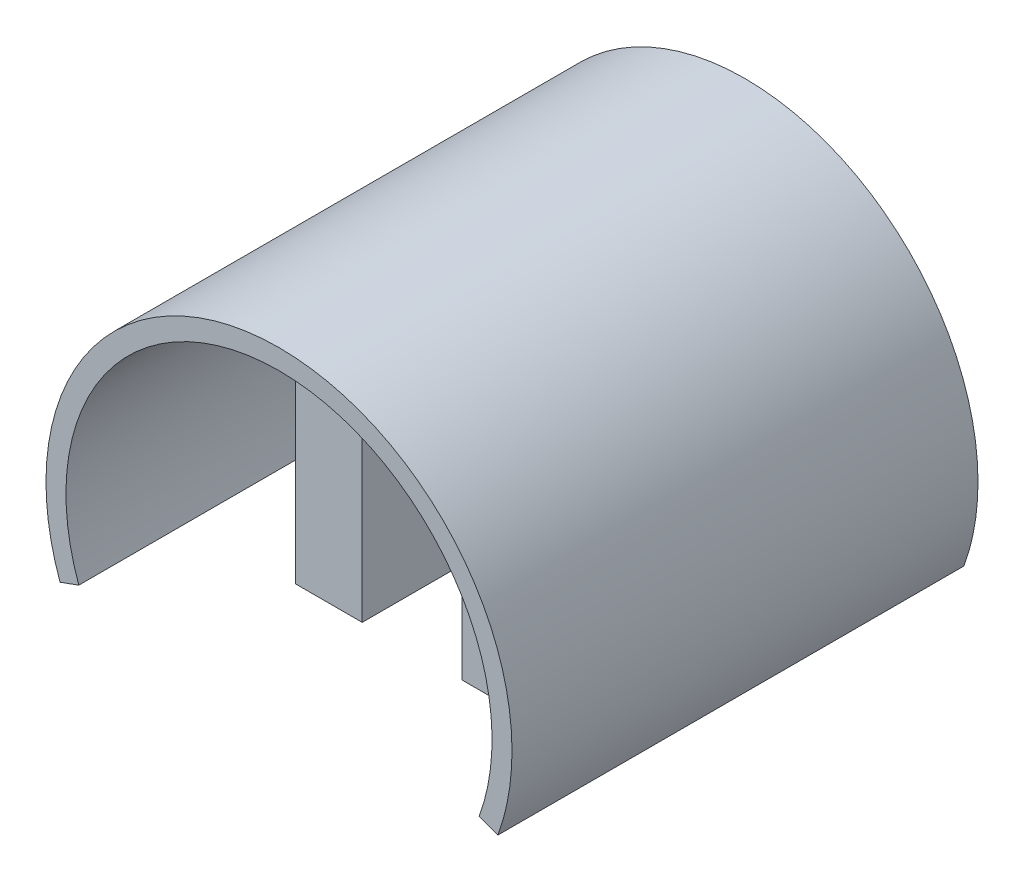
ISO-10303-21;
HEADER;
FILE_DESCRIPTION(('STEP AP214'),'2;1');
FILE_NAME('part.step','',(''),(''),'','','');
FILE_SCHEMA(('AUTOMOTIVE_DESIGN { 1 0 10303 214 1 1 1 1 }'));
ENDSEC;
DATA;
#1=APPLICATION_CONTEXT('core data for automotive mechanical design processes');
#2=APPLICATION_PROTOCOL_DEFINITION('international standard','automotive_design',2000,#1);
#3=PRODUCT_CONTEXT('',#1,'mechanical');
#4=PRODUCT('Part','Part','',(#3));
#5=PRODUCT_RELATED_PRODUCT_CATEGORY('part','',(#4));
#6=PRODUCT_DEFINITION_FORMATION('','',#4);
#7=PRODUCT_DEFINITION_CONTEXT('part definition',#1,'design');
#8=PRODUCT_DEFINITION('design','',#6,#7);
#9=PRODUCT_DEFINITION_SHAPE('','',#8);
#10=(LENGTH_UNIT() NAMED_UNIT(*) SI_UNIT(.MILLI.,.METRE.));
#11=(NAMED_UNIT(*) PLANE_ANGLE_UNIT() SI_UNIT($,.RADIAN.));
#12=(NAMED_UNIT(*) SI_UNIT($,.STERADIAN.) SOLID_ANGLE_UNIT());
#13=UNCERTAINTY_MEASURE_WITH_UNIT(LENGTH_MEASURE(1.E-05),#10,'distance_accuracy_value','');
#14=(GEOMETRIC_REPRESENTATION_CONTEXT(3) GLOBAL_UNCERTAINTY_ASSIGNED_CONTEXT((#13)) GLOBAL_UNIT_ASSIGNED_CONTEXT((#10,
#11,#12)) REPRESENTATION_CONTEXT('',''));
#15=CARTESIAN_POINT('',(0.,0.,0.));
#16=DIRECTION('',(0.,0.,1.));
#17=DIRECTION('',(1.,0.,0.));
#18=AXIS2_PLACEMENT_3D('',#15,#16,#17);
#19=CARTESIAN_POINT('',(-7.49999999999999,31.1086804606046,0.));
#20=DIRECTION('',(1.,0.,0.));
#21=DIRECTION('',(0.,1.,0.));
#22=AXIS2_PLACEMENT_3D('',#19,#20,#21);
#23=PLANE('',#22);
#24=DIRECTION('',(0.,1.,0.));
#25=VECTOR('',#24,1.);
#26=CARTESIAN_POINT('',(-7.49999999999999,31.1086804606046,0.));
#27=LINE('',#26,#25);
#28=CARTESIAN_POINT('',(-7.5,-14.5,0.));
#29=VERTEX_POINT('',#28);
#30=CARTESIAN_POINT('',(-7.49999999999999,29.4915242061173,0.));
#31=VERTEX_POINT('',#30);
#32=EDGE_CURVE('E199',#29,#31,#27,.T.);
#33=ORIENTED_EDGE('',*,*,#32,.T.);
#34=DIRECTION('',(0.,0.,1.));
#35=VECTOR('',#34,1.);
#36=CARTESIAN_POINT('',(-7.49999999999999,29.4915242061173,50.));
#37=LINE('',#36,#35);
#38=CARTESIAN_POINT('',(-7.49999999999999,29.4915242061173,50.));
#39=VERTEX_POINT('',#38);
#40=EDGE_CURVE('E226',#31,#39,#37,.T.);
#41=ORIENTED_EDGE('',*,*,#40,.T.);
#42=DIRECTION('',(0.,-1.,0.));
#43=VECTOR('',#42,1.);
#44=CARTESIAN_POINT('',(-7.49999999999999,31.1086804606046,50.));
#45=LINE('',#44,#43);
#46=CARTESIAN_POINT('',(-7.5,-14.5,50.));
#47=VERTEX_POINT('',#46);
#48=EDGE_CURVE('E280',#39,#47,#45,.T.);
#49=ORIENTED_EDGE('',*,*,#48,.T.);
#50=DIRECTION('',(0.,0.,1.));
#51=VECTOR('',#50,1.);
#52=CARTESIAN_POINT('',(-7.5,-14.5,0.));
#53=LINE('',#52,#51);
#54=EDGE_CURVE('E187',#29,#47,#53,.T.);
#55=ORIENTED_EDGE('',*,*,#54,.F.);
#56=EDGE_LOOP('',(#33,#41,#49,#55));
#57=FACE_BOUND('',#56,.T.);
#58=ADVANCED_FACE('F33',(#57),#23,.T.);
#59=CARTESIAN_POINT('',(-17.5,-26.7908566492376,0.));
#60=DIRECTION('',(-1.,0.,0.));
#61=DIRECTION('',(0.,-1.,0.));
#62=AXIS2_PLACEMENT_3D('',#59,#60,#61);
#63=PLANE('',#62);
#64=DIRECTION('',(0.,1.,0.));
#65=VECTOR('',#64,1.);
#66=CARTESIAN_POINT('',(-17.5,-26.7908566492376,50.));
#67=LINE('',#66,#65);
#68=CARTESIAN_POINT('',(-17.5,-14.5,50.));
#69=VERTEX_POINT('',#68);
#70=CARTESIAN_POINT('',(-17.5,22.798026230356,50.));
#71=VERTEX_POINT('',#70);
#72=EDGE_CURVE('E283',#69,#71,#67,.T.);
#73=ORIENTED_EDGE('',*,*,#72,.T.);
#74=DIRECTION('',(0.,0.,1.));
#75=VECTOR('',#74,1.);
#76=CARTESIAN_POINT('',(-17.5,22.798026230356,0.));
#77=LINE('',#76,#75);
#78=CARTESIAN_POINT('',(-17.5,22.798026230356,0.));
#79=VERTEX_POINT('',#78);
#80=EDGE_CURVE('E224',#71,#79,#77,.F.);
#81=ORIENTED_EDGE('',*,*,#80,.T.);
#82=DIRECTION('',(0.,-1.,0.));
#83=VECTOR('',#82,1.);
#84=CARTESIAN_POINT('',(-17.5,-26.7908566492376,0.));
#85=LINE('',#84,#83);
#86=CARTESIAN_POINT('',(-17.5,-14.5,0.));
#87=VERTEX_POINT('',#86);
#88=EDGE_CURVE('E197',#79,#87,#85,.T.);
#89=ORIENTED_EDGE('',*,*,#88,.T.);
#90=DIRECTION('',(0.,0.,-1.));
#91=VECTOR('',#90,1.);
#92=CARTESIAN_POINT('',(-17.5,-14.5,70.));
#93=LINE('',#92,#91);
#94=EDGE_CURVE('E190',#69,#87,#93,.T.);
#95=ORIENTED_EDGE('',*,*,#94,.F.);
#96=EDGE_LOOP('',(#73,#81,#89,#95));
#97=FACE_BOUND('',#96,.T.);
#98=ADVANCED_FACE('F341',(#97),#63,.T.);
#99=CARTESIAN_POINT('',(17.5,-26.7908566492376,0.));
#100=DIRECTION('',(1.,0.,0.));
#101=DIRECTION('',(0.,1.,0.));
#102=AXIS2_PLACEMENT_3D('',#99,#100,#101);
#103=PLANE('',#102);
#104=DIRECTION('',(0.,1.,0.));
#105=VECTOR('',#104,1.);
#106=CARTESIAN_POINT('',(17.5,-26.7908566492376,0.));
#107=LINE('',#106,#105);
#108=CARTESIAN_POINT('',(17.5,-14.5,0.));
#109=VERTEX_POINT('',#108);
#110=CARTESIAN_POINT('',(17.5,22.798026230356,0.));
#111=VERTEX_POINT('',#110);
#112=EDGE_CURVE('E195',#109,#111,#107,.T.);
#113=ORIENTED_EDGE('',*,*,#112,.T.);
#114=DIRECTION('',(0.,0.,1.));
#115=VECTOR('',#114,1.);
#116=CARTESIAN_POINT('',(17.5,22.798026230356,50.));
#117=LINE('',#116,#115);
#118=CARTESIAN_POINT('',(17.5,22.798026230356,50.));
#119=VERTEX_POINT('',#118);
#120=EDGE_CURVE('E155',#111,#119,#117,.T.);
#121=ORIENTED_EDGE('',*,*,#120,.T.);
#122=DIRECTION('',(0.,-1.,0.));
#123=VECTOR('',#122,1.);
#124=CARTESIAN_POINT('',(17.5,-26.7908566492376,50.));
#125=LINE('',#124,#123);
#126=CARTESIAN_POINT('',(17.5,-14.5,50.));
#127=VERTEX_POINT('',#126);
#128=EDGE_CURVE('E147',#119,#127,#125,.T.);
#129=ORIENTED_EDGE('',*,*,#128,.T.);
#130=DIRECTION('',(0.,0.,1.));
#131=VECTOR('',#130,1.);
#132=CARTESIAN_POINT('',(17.5,-14.5,0.));
#133=LINE('',#132,#131);
#134=EDGE_CURVE('E152',#109,#127,#133,.T.);
#135=ORIENTED_EDGE('',*,*,#134,.F.);
#136=EDGE_LOOP('',(#113,#121,#129,#135));
#137=FACE_BOUND('',#136,.T.);
#138=ADVANCED_FACE('F150',(#137),#103,.T.);
#139=CARTESIAN_POINT('',(7.49999999999999,31.1086804606046,0.));
#140=DIRECTION('',(-1.,0.,0.));
#141=DIRECTION('',(0.,-1.,0.));
#142=AXIS2_PLACEMENT_3D('',#139,#140,#141);
#143=PLANE('',#142);
#144=DIRECTION('',(0.,1.,0.));
#145=VECTOR('',#144,1.);
#146=CARTESIAN_POINT('',(7.49999999999999,31.1086804606046,50.));
#147=LINE('',#146,#145);
#148=CARTESIAN_POINT('',(7.5,-14.5,50.));
#149=VERTEX_POINT('',#148);
#150=CARTESIAN_POINT('',(7.49999999999999,29.4915242061173,50.));
#151=VERTEX_POINT('',#150);
#152=EDGE_CURVE('E158',#149,#151,#147,.T.);
#153=ORIENTED_EDGE('',*,*,#152,.T.);
#154=DIRECTION('',(0.,0.,1.));
#155=VECTOR('',#154,1.);
#156=CARTESIAN_POINT('',(7.49999999999999,29.4915242061173,0.));
#157=LINE('',#156,#155);
#158=CARTESIAN_POINT('',(7.49999999999999,29.4915242061173,0.));
#159=VERTEX_POINT('',#158);
#160=EDGE_CURVE('E48',#151,#159,#157,.F.);
#161=ORIENTED_EDGE('',*,*,#160,.T.);
#162=DIRECTION('',(0.,-1.,0.));
#163=VECTOR('',#162,1.);
#164=CARTESIAN_POINT('',(7.49999999999999,31.1086804606046,0.));
#165=LINE('',#164,#163);
#166=CARTESIAN_POINT('',(7.5,-14.5,0.));
#167=VERTEX_POINT('',#166);
#168=EDGE_CURVE('E193',#159,#167,#165,.T.);
#169=ORIENTED_EDGE('',*,*,#168,.T.);
#170=DIRECTION('',(0.,0.,-1.));
#171=VECTOR('',#170,1.);
#172=CARTESIAN_POINT('',(7.5,-14.5,70.));
#173=LINE('',#172,#171);
#174=EDGE_CURVE('E171',#149,#167,#173,.T.);
#175=ORIENTED_EDGE('',*,*,#174,.F.);
#176=EDGE_LOOP('',(#153,#161,#169,#175));
#177=FACE_BOUND('',#176,.T.);
#178=ADVANCED_FACE('F268',(#177),#143,.T.);
#179=CARTESIAN_POINT('',(0.,-14.5,0.));
#180=DIRECTION('',(0.,-1.,0.));
#181=DIRECTION('',(0.,0.,-1.));
#182=AXIS2_PLACEMENT_3D('',#179,#180,#181);
#183=PLANE('',#182);
#184=CARTESIAN_POINT('',(-12.5,-14.5,40.));
#185=DIRECTION('',(0.,-1.,0.));
#186=DIRECTION('',(0.,0.,-1.));
#187=AXIS2_PLACEMENT_3D('',#184,#185,#186);
#188=CIRCLE('',#187,3.2);
#189=CARTESIAN_POINT('',(-12.5,-14.5,36.8));
#190=VERTEX_POINT('',#189);
#191=EDGE_CURVE('E181',#190,#190,#188,.T.);
#192=ORIENTED_EDGE('',*,*,#191,.F.);
#193=EDGE_LOOP('',(#192));
#194=FACE_BOUND('',#193,.T.);
#195=CARTESIAN_POINT('',(-12.5,-14.5,10.));
#196=DIRECTION('',(0.,-1.,0.));
#197=DIRECTION('',(0.,0.,-1.));
#198=AXIS2_PLACEMENT_3D('',#195,#196,#197);
#199=CIRCLE('',#198,3.2);
#200=CARTESIAN_POINT('',(-12.5,-14.5,6.8));
#201=VERTEX_POINT('',#200);
#202=EDGE_CURVE('E173',#201,#201,#199,.T.);
#203=ORIENTED_EDGE('',*,*,#202,.F.);
#204=EDGE_LOOP('',(#203));
#205=FACE_BOUND('',#204,.T.);
#206=ORIENTED_EDGE('',*,*,#54,.T.);
#207=DIRECTION('',(-1.,0.,0.));
#208=VECTOR('',#207,1.);
#209=CARTESIAN_POINT('',(0.,-14.5,50.));
#210=LINE('',#209,#208);
#211=EDGE_CURVE('E157',#47,#69,#210,.T.);
#212=ORIENTED_EDGE('',*,*,#211,.T.);
#213=ORIENTED_EDGE('',*,*,#94,.T.);
#214=DIRECTION('',(1.,0.,0.));
#215=VECTOR('',#214,1.);
#216=CARTESIAN_POINT('',(-17.5,-14.5,0.));
#217=LINE('',#216,#215);
#218=EDGE_CURVE('E184',#87,#29,#217,.T.);
#219=ORIENTED_EDGE('',*,*,#218,.T.);
#220=EDGE_LOOP('',(#206,#212,#213,#219));
#221=FACE_BOUND('',#220,.T.);
#222=ADVANCED_FACE('F265',(#194,#205,#221),#183,.T.);
#223=CARTESIAN_POINT('',(0.,-14.5,0.));
#224=DIRECTION('',(0.,-1.,0.));
#225=DIRECTION('',(0.,0.,-1.));
#226=AXIS2_PLACEMENT_3D('',#223,#224,#225);
#227=PLANE('',#226);
#228=CARTESIAN_POINT('',(12.5,-14.5,40.));
#229=DIRECTION('',(0.,-1.,0.));
#230=DIRECTION('',(0.,0.,-1.));
#231=AXIS2_PLACEMENT_3D('',#228,#229,#230);
#232=CIRCLE('',#231,3.2);
#233=CARTESIAN_POINT('',(12.5,-14.5,36.8));
#234=VERTEX_POINT('',#233);
#235=EDGE_CURVE('E175',#234,#234,#232,.T.);
#236=ORIENTED_EDGE('',*,*,#235,.F.);
#237=EDGE_LOOP('',(#236));
#238=FACE_BOUND('',#237,.T.);
#239=CARTESIAN_POINT('',(12.5,-14.5,10.));
#240=DIRECTION('',(0.,-1.,0.));
#241=DIRECTION('',(0.,0.,-1.));
#242=AXIS2_PLACEMENT_3D('',#239,#240,#241);
#243=CIRCLE('',#242,3.2);
#244=CARTESIAN_POINT('',(12.5,-14.5,6.8));
#245=VERTEX_POINT('',#244);
#246=EDGE_CURVE('E311',#245,#245,#243,.T.);
#247=ORIENTED_EDGE('',*,*,#246,.F.);
#248=EDGE_LOOP('',(#247));
#249=FACE_BOUND('',#248,.T.);
#250=ORIENTED_EDGE('',*,*,#134,.T.);
#251=DIRECTION('',(-1.,0.,0.));
#252=VECTOR('',#251,1.);
#253=CARTESIAN_POINT('',(0.,-14.5,50.));
#254=LINE('',#253,#252);
#255=EDGE_CURVE('E161',#127,#149,#254,.T.);
#256=ORIENTED_EDGE('',*,*,#255,.T.);
#257=ORIENTED_EDGE('',*,*,#174,.T.);
#258=DIRECTION('',(1.,0.,0.));
#259=VECTOR('',#258,1.);
#260=CARTESIAN_POINT('',(7.5,-14.5,0.));
#261=LINE('',#260,#259);
#262=EDGE_CURVE('E170',#167,#109,#261,.T.);
#263=ORIENTED_EDGE('',*,*,#262,.T.);
#264=EDGE_LOOP('',(#250,#256,#257,#263));
#265=FACE_BOUND('',#264,.T.);
#266=ADVANCED_FACE('F168',(#238,#249,#265),#227,.T.);
#267=CARTESIAN_POINT('',(0.,0.,70.));
#268=DIRECTION('',(0.,0.,1.));
#269=DIRECTION('',(1.,0.,0.));
#270=AXIS2_PLACEMENT_3D('',#267,#268,#269);
#271=PLANE('',#270);
#272=CARTESIAN_POINT('',(0.,0.,70.));
#273=DIRECTION('',(0.,0.,1.));
#274=DIRECTION('',(1.,0.,0.));
#275=AXIS2_PLACEMENT_3D('',#272,#273,#274);
#276=CIRCLE('',#275,32.);
#277=CARTESIAN_POINT('',(30.0701638651491,-10.9446445864214,70.));
#278=VERTEX_POINT('',#277);
#279=CARTESIAN_POINT('',(-30.0701638651491,-10.9446445864214,70.));
#280=VERTEX_POINT('',#279);
#281=EDGE_CURVE('E203',#278,#280,#276,.T.);
#282=ORIENTED_EDGE('',*,*,#281,.F.);
#283=DIRECTION('',(0.939692620785908,-0.34202014332567,0.));
#284=VECTOR('',#283,1.);
#285=CARTESIAN_POINT('',(32.8892417275068,-11.9707050163984,70.));
#286=LINE('',#285,#284);
#287=CARTESIAN_POINT('',(32.8892417275068,-11.9707050163984,70.));
#288=VERTEX_POINT('',#287);
#289=EDGE_CURVE('E299',#278,#288,#286,.T.);
#290=ORIENTED_EDGE('',*,*,#289,.T.);
#291=CARTESIAN_POINT('',(0.,0.,70.));
#292=DIRECTION('',(0.,0.,1.));
#293=DIRECTION('',(1.,0.,0.));
#294=AXIS2_PLACEMENT_3D('',#291,#292,#293);
#295=CIRCLE('',#294,35.);
#296=CARTESIAN_POINT('',(-32.8892417275068,-11.9707050163984,70.));
#297=VERTEX_POINT('',#296);
#298=EDGE_CURVE('E211',#288,#297,#295,.T.);
#299=ORIENTED_EDGE('',*,*,#298,.T.);
#300=DIRECTION('',(0.939692620785908,0.34202014332567,0.));
#301=VECTOR('',#300,1.);
#302=CARTESIAN_POINT('',(-32.8892417275068,-11.9707050163984,70.));
#303=LINE('',#302,#301);
#304=EDGE_CURVE('E282',#297,#280,#303,.T.);
#305=ORIENTED_EDGE('',*,*,#304,.T.);
#306=EDGE_LOOP('',(#282,#290,#299,#305));
#307=FACE_BOUND('',#306,.T.);
#308=ADVANCED_FACE('F322',(#307),#271,.T.);
#309=CARTESIAN_POINT('',(0.,0.,0.));
#310=DIRECTION('',(0.,0.,1.));
#311=DIRECTION('',(1.,0.,0.));
#312=AXIS2_PLACEMENT_3D('',#309,#310,#311);
#313=PLANE('',#312);
#314=CARTESIAN_POINT('',(0.,0.,0.));
#315=DIRECTION('',(0.,0.,1.));
#316=DIRECTION('',(1.,0.,0.));
#317=AXIS2_PLACEMENT_3D('',#314,#315,#316);
#318=CIRCLE('',#317,35.);
#319=CARTESIAN_POINT('',(32.8892417275068,-11.9707050163984,0.));
#320=VERTEX_POINT('',#319);
#321=CARTESIAN_POINT('',(-32.8892417275068,-11.9707050163984,0.));
#322=VERTEX_POINT('',#321);
#323=EDGE_CURVE('E206',#320,#322,#318,.T.);
#324=ORIENTED_EDGE('',*,*,#323,.F.);
#325=DIRECTION('',(0.939692620785908,-0.34202014332567,0.));
#326=VECTOR('',#325,1.);
#327=CARTESIAN_POINT('',(32.8892417275068,-11.9707050163984,0.));
#328=LINE('',#327,#326);
#329=CARTESIAN_POINT('',(30.0701638651491,-10.9446445864214,0.));
#330=VERTEX_POINT('',#329);
#331=EDGE_CURVE('E302',#330,#320,#328,.T.);
#332=ORIENTED_EDGE('',*,*,#331,.F.);
#333=CARTESIAN_POINT('',(0.,0.,0.));
#334=DIRECTION('',(0.,0.,1.));
#335=DIRECTION('',(1.,0.,0.));
#336=AXIS2_PLACEMENT_3D('',#333,#334,#335);
#337=CIRCLE('',#336,32.);
#338=CARTESIAN_POINT('',(20.8,24.3178946457131,0.));
#339=VERTEX_POINT('',#338);
#340=EDGE_CURVE('E208',#330,#339,#337,.T.);
#341=ORIENTED_EDGE('',*,*,#340,.T.);
#342=CARTESIAN_POINT('',(19.5,22.798026230356,0.));
#343=DIRECTION('',(0.,0.,1.));
#344=DIRECTION('',(1.,0.,0.));
#345=AXIS2_PLACEMENT_3D('',#342,#343,#344);
#346=CIRCLE('',#345,2.);
#347=EDGE_CURVE('E242',#339,#111,#346,.T.);
#348=ORIENTED_EDGE('',*,*,#347,.T.);
#349=ORIENTED_EDGE('',*,*,#112,.F.);
#350=ORIENTED_EDGE('',*,*,#262,.F.);
#351=ORIENTED_EDGE('',*,*,#168,.F.);
#352=CARTESIAN_POINT('',(5.49999999999999,29.4915242061173,0.));
#353=DIRECTION('',(0.,0.,1.));
#354=DIRECTION('',(1.,0.,0.));
#355=AXIS2_PLACEMENT_3D('',#352,#353,#354);
#356=CIRCLE('',#355,2.);
#357=CARTESIAN_POINT('',(5.86666666666666,31.4576258198584,0.));
#358=VERTEX_POINT('',#357);
#359=EDGE_CURVE('E245',#159,#358,#356,.T.);
#360=ORIENTED_EDGE('',*,*,#359,.T.);
#361=CARTESIAN_POINT('',(-5.86666666666666,31.4576258198584,0.));
#362=VERTEX_POINT('',#361);
#363=EDGE_CURVE('E202',#358,#362,#337,.T.);
#364=ORIENTED_EDGE('',*,*,#363,.T.);
#365=CARTESIAN_POINT('',(-5.49999999999999,29.4915242061173,0.));
#366=DIRECTION('',(0.,0.,1.));
#367=DIRECTION('',(1.,0.,0.));
#368=AXIS2_PLACEMENT_3D('',#365,#366,#367);
#369=CIRCLE('',#368,2.);
#370=EDGE_CURVE('E238',#362,#31,#369,.T.);
#371=ORIENTED_EDGE('',*,*,#370,.T.);
#372=ORIENTED_EDGE('',*,*,#32,.F.);
#373=ORIENTED_EDGE('',*,*,#218,.F.);
#374=ORIENTED_EDGE('',*,*,#88,.F.);
#375=CARTESIAN_POINT('',(-19.5,22.798026230356,0.));
#376=DIRECTION('',(0.,0.,1.));
#377=DIRECTION('',(1.,0.,0.));
#378=AXIS2_PLACEMENT_3D('',#375,#376,#377);
#379=CIRCLE('',#378,2.);
#380=CARTESIAN_POINT('',(-20.8,24.3178946457131,0.));
#381=VERTEX_POINT('',#380);
#382=EDGE_CURVE('E233',#79,#381,#379,.T.);
#383=ORIENTED_EDGE('',*,*,#382,.T.);
#384=CARTESIAN_POINT('',(-30.0701638651491,-10.9446445864214,0.));
#385=VERTEX_POINT('',#384);
#386=EDGE_CURVE('E207',#381,#385,#337,.T.);
#387=ORIENTED_EDGE('',*,*,#386,.T.);
#388=DIRECTION('',(0.939692620785908,0.34202014332567,0.));
#389=VECTOR('',#388,1.);
#390=CARTESIAN_POINT('',(-32.8892417275068,-11.9707050163984,0.));
#391=LINE('',#390,#389);
#392=EDGE_CURVE('E291',#322,#385,#391,.T.);
#393=ORIENTED_EDGE('',*,*,#392,.F.);
#394=EDGE_LOOP('',(#324,#332,#341,#348,#349,#350,#351,#360,#364,#371,#372,#373,#374,#383,#387,#393));
#395=FACE_BOUND('',#394,.T.);
#396=ADVANCED_FACE('F357',(#395),#313,.F.);
#397=CARTESIAN_POINT('',(0.,0.,70.));
#398=DIRECTION('',(0.,0.,-1.));
#399=DIRECTION('',(-1.,0.,0.));
#400=AXIS2_PLACEMENT_3D('',#397,#398,#399);
#401=CYLINDRICAL_SURFACE('',#400,35.);
#402=ORIENTED_EDGE('',*,*,#298,.F.);
#403=DIRECTION('',(0.,0.,1.));
#404=VECTOR('',#403,1.);
#405=CARTESIAN_POINT('',(32.8892417275068,-11.9707050163984,0.));
#406=LINE('',#405,#404);
#407=EDGE_CURVE('E308',#320,#288,#406,.T.);
#408=ORIENTED_EDGE('',*,*,#407,.F.);
#409=ORIENTED_EDGE('',*,*,#323,.T.);
#410=DIRECTION('',(0.,0.,1.));
#411=VECTOR('',#410,1.);
#412=CARTESIAN_POINT('',(-32.8892417275068,-11.9707050163984,0.));
#413=LINE('',#412,#411);
#414=EDGE_CURVE('E294',#322,#297,#413,.T.);
#415=ORIENTED_EDGE('',*,*,#414,.T.);
#416=EDGE_LOOP('',(#402,#408,#409,#415));
#417=FACE_BOUND('',#416,.T.);
#418=ADVANCED_FACE('F353',(#417),#401,.T.);
#419=CARTESIAN_POINT('',(0.,0.,70.));
#420=DIRECTION('',(0.,0.,-1.));
#421=DIRECTION('',(-1.,0.,0.));
#422=AXIS2_PLACEMENT_3D('',#419,#420,#421);
#423=CYLINDRICAL_SURFACE('',#422,32.);
#424=ORIENTED_EDGE('',*,*,#386,.F.);
#425=DIRECTION('',(0.,0.,-1.));
#426=VECTOR('',#425,1.);
#427=CARTESIAN_POINT('',(-20.8,24.3178946457131,70.));
#428=LINE('',#427,#426);
#429=CARTESIAN_POINT('',(-20.8,24.3178946457131,50.));
#430=VERTEX_POINT('',#429);
#431=EDGE_CURVE('E221',#381,#430,#428,.F.);
#432=ORIENTED_EDGE('',*,*,#431,.T.);
#433=CARTESIAN_POINT('',(0.,0.,50.));
#434=DIRECTION('',(0.,0.,1.));
#435=DIRECTION('',(1.,0.,0.));
#436=AXIS2_PLACEMENT_3D('',#433,#434,#435);
#437=CIRCLE('',#436,32.);
#438=CARTESIAN_POINT('',(-5.86666666666666,31.4576258198584,50.));
#439=VERTEX_POINT('',#438);
#440=EDGE_CURVE('E403',#439,#430,#437,.T.);
#441=ORIENTED_EDGE('',*,*,#440,.F.);
#442=DIRECTION('',(0.,0.,-1.));
#443=VECTOR('',#442,1.);
#444=CARTESIAN_POINT('',(-5.86666666666666,31.4576258198584,70.));
#445=LINE('',#444,#443);
#446=EDGE_CURVE('E219',#439,#362,#445,.T.);
#447=ORIENTED_EDGE('',*,*,#446,.T.);
#448=ORIENTED_EDGE('',*,*,#363,.F.);
#449=DIRECTION('',(0.,0.,-1.));
#450=VECTOR('',#449,1.);
#451=CARTESIAN_POINT('',(5.86666666666666,31.4576258198584,70.));
#452=LINE('',#451,#450);
#453=CARTESIAN_POINT('',(5.86666666666666,31.4576258198584,50.));
#454=VERTEX_POINT('',#453);
#455=EDGE_CURVE('E213',#358,#454,#452,.F.);
#456=ORIENTED_EDGE('',*,*,#455,.T.);
#457=CARTESIAN_POINT('',(20.8,24.3178946457131,50.));
#458=VERTEX_POINT('',#457);
#459=EDGE_CURVE('E166',#458,#454,#437,.T.);
#460=ORIENTED_EDGE('',*,*,#459,.F.);
#461=DIRECTION('',(0.,0.,-1.));
#462=VECTOR('',#461,1.);
#463=CARTESIAN_POINT('',(20.8,24.3178946457131,70.));
#464=LINE('',#463,#462);
#465=EDGE_CURVE('E217',#458,#339,#464,.T.);
#466=ORIENTED_EDGE('',*,*,#465,.T.);
#467=ORIENTED_EDGE('',*,*,#340,.F.);
#468=DIRECTION('',(0.,0.,1.));
#469=VECTOR('',#468,1.);
#470=CARTESIAN_POINT('',(30.0701638651491,-10.9446445864214,0.));
#471=LINE('',#470,#469);
#472=EDGE_CURVE('E305',#330,#278,#471,.T.);
#473=ORIENTED_EDGE('',*,*,#472,.T.);
#474=ORIENTED_EDGE('',*,*,#281,.T.);
#475=DIRECTION('',(0.,0.,1.));
#476=VECTOR('',#475,1.);
#477=CARTESIAN_POINT('',(-30.0701638651491,-10.9446445864214,0.));
#478=LINE('',#477,#476);
#479=EDGE_CURVE('E297',#385,#280,#478,.T.);
#480=ORIENTED_EDGE('',*,*,#479,.F.);
#481=EDGE_LOOP('',(#424,#432,#441,#447,#448,#456,#460,#466,#467,#473,#474,#480));
#482=FACE_BOUND('',#481,.T.);
#483=ADVANCED_FACE('F261',(#482),#423,.F.);
#484=CARTESIAN_POINT('',(-12.5,20.,40.));
#485=DIRECTION('',(0.,-1.,0.));
#486=DIRECTION('',(0.,0.,-1.));
#487=AXIS2_PLACEMENT_3D('',#484,#485,#486);
#488=CYLINDRICAL_SURFACE('',#487,3.2);
#489=CARTESIAN_POINT('',(-12.5,-13.,40.));
#490=DIRECTION('',(0.,-1.,0.));
#491=DIRECTION('',(0.,0.,-1.));
#492=AXIS2_PLACEMENT_3D('',#489,#490,#491);
#493=CIRCLE('',#492,3.2);
#494=CARTESIAN_POINT('',(-12.5,-13.,36.8));
#495=VERTEX_POINT('',#494);
#496=EDGE_CURVE('E41',#495,#495,#493,.T.);
#497=ORIENTED_EDGE('',*,*,#496,.F.);
#498=EDGE_LOOP('',(#497));
#499=FACE_BOUND('',#498,.T.);
#500=ORIENTED_EDGE('',*,*,#191,.T.);
#501=EDGE_LOOP('',(#500));
#502=FACE_BOUND('',#501,.T.);
#503=ADVANCED_FACE('F257',(#499,#502),#488,.F.);
#504=CARTESIAN_POINT('',(-12.5,20.,10.));
#505=DIRECTION('',(0.,-1.,0.));
#506=DIRECTION('',(0.,0.,-1.));
#507=AXIS2_PLACEMENT_3D('',#504,#505,#506);
#508=CYLINDRICAL_SURFACE('',#507,3.2);
#509=CARTESIAN_POINT('',(-12.5,-13.,10.));
#510=DIRECTION('',(0.,-1.,0.));
#511=DIRECTION('',(0.,0.,-1.));
#512=AXIS2_PLACEMENT_3D('',#509,#510,#511);
#513=CIRCLE('',#512,3.2);
#514=CARTESIAN_POINT('',(-12.5,-13.,6.8));
#515=VERTEX_POINT('',#514);
#516=EDGE_CURVE('E11',#515,#515,#513,.T.);
#517=ORIENTED_EDGE('',*,*,#516,.F.);
#518=EDGE_LOOP('',(#517));
#519=FACE_BOUND('',#518,.T.);
#520=ORIENTED_EDGE('',*,*,#202,.T.);
#521=EDGE_LOOP('',(#520));
#522=FACE_BOUND('',#521,.T.);
#523=ADVANCED_FACE('F260',(#519,#522),#508,.F.);
#524=CARTESIAN_POINT('',(12.5,20.,10.));
#525=DIRECTION('',(0.,-1.,0.));
#526=DIRECTION('',(0.,0.,-1.));
#527=AXIS2_PLACEMENT_3D('',#524,#525,#526);
#528=CYLINDRICAL_SURFACE('',#527,3.2);
#529=CARTESIAN_POINT('',(12.5,-13.,10.));
#530=DIRECTION('',(0.,-1.,0.));
#531=DIRECTION('',(0.,0.,-1.));
#532=AXIS2_PLACEMENT_3D('',#529,#530,#531);
#533=CIRCLE('',#532,3.2);
#534=CARTESIAN_POINT('',(12.5,-13.,6.8));
#535=VERTEX_POINT('',#534);
#536=EDGE_CURVE('E247',#535,#535,#533,.T.);
#537=ORIENTED_EDGE('',*,*,#536,.F.);
#538=EDGE_LOOP('',(#537));
#539=FACE_BOUND('',#538,.T.);
#540=ORIENTED_EDGE('',*,*,#246,.T.);
#541=EDGE_LOOP('',(#540));
#542=FACE_BOUND('',#541,.T.);
#543=ADVANCED_FACE('F326',(#539,#542),#528,.F.);
#544=CARTESIAN_POINT('',(12.5,20.,40.));
#545=DIRECTION('',(0.,-1.,0.));
#546=DIRECTION('',(0.,0.,-1.));
#547=AXIS2_PLACEMENT_3D('',#544,#545,#546);
#548=CYLINDRICAL_SURFACE('',#547,3.2);
#549=CARTESIAN_POINT('',(12.5,-13.,40.));
#550=DIRECTION('',(0.,-1.,0.));
#551=DIRECTION('',(0.,0.,-1.));
#552=AXIS2_PLACEMENT_3D('',#549,#550,#551);
#553=CIRCLE('',#552,3.2);
#554=CARTESIAN_POINT('',(12.5,-13.,36.8));
#555=VERTEX_POINT('',#554);
#556=EDGE_CURVE('E250',#555,#555,#553,.T.);
#557=ORIENTED_EDGE('',*,*,#556,.F.);
#558=EDGE_LOOP('',(#557));
#559=FACE_BOUND('',#558,.T.);
#560=ORIENTED_EDGE('',*,*,#235,.T.);
#561=EDGE_LOOP('',(#560));
#562=FACE_BOUND('',#561,.T.);
#563=ADVANCED_FACE('F318',(#559,#562),#548,.F.);
#564=CARTESIAN_POINT('',(32.8892417275068,-11.9707050163984,0.));
#565=DIRECTION('',(-0.34202014332567,-0.939692620785908,0.));
#566=DIRECTION('',(0.939692620785908,-0.34202014332567,0.));
#567=AXIS2_PLACEMENT_3D('',#564,#565,#566);
#568=PLANE('',#567);
#569=ORIENTED_EDGE('',*,*,#289,.F.);
#570=ORIENTED_EDGE('',*,*,#472,.F.);
#571=ORIENTED_EDGE('',*,*,#331,.T.);
#572=ORIENTED_EDGE('',*,*,#407,.T.);
#573=EDGE_LOOP('',(#569,#570,#571,#572));
#574=FACE_BOUND('',#573,.T.);
#575=ADVANCED_FACE('F334',(#574),#568,.T.);
#576=CARTESIAN_POINT('',(-32.8892417275068,-11.9707050163984,0.));
#577=DIRECTION('',(0.34202014332567,-0.939692620785908,0.));
#578=DIRECTION('',(0.939692620785908,0.34202014332567,0.));
#579=AXIS2_PLACEMENT_3D('',#576,#577,#578);
#580=PLANE('',#579);
#581=ORIENTED_EDGE('',*,*,#304,.F.);
#582=ORIENTED_EDGE('',*,*,#414,.F.);
#583=ORIENTED_EDGE('',*,*,#392,.T.);
#584=ORIENTED_EDGE('',*,*,#479,.T.);
#585=EDGE_LOOP('',(#581,#582,#583,#584));
#586=FACE_BOUND('',#585,.T.);
#587=ADVANCED_FACE('F394',(#586),#580,.T.);
#588=CARTESIAN_POINT('',(0.,0.,50.));
#589=DIRECTION('',(0.,0.,1.));
#590=DIRECTION('',(1.,0.,0.));
#591=AXIS2_PLACEMENT_3D('',#588,#589,#590);
#592=PLANE('',#591);
#593=ORIENTED_EDGE('',*,*,#459,.T.);
#594=CARTESIAN_POINT('',(5.49999999999999,29.4915242061173,50.));
#595=DIRECTION('',(0.,0.,1.));
#596=DIRECTION('',(1.,0.,0.));
#597=AXIS2_PLACEMENT_3D('',#594,#595,#596);
#598=CIRCLE('',#597,2.);
#599=EDGE_CURVE('E56',#454,#151,#598,.F.);
#600=ORIENTED_EDGE('',*,*,#599,.T.);
#601=ORIENTED_EDGE('',*,*,#152,.F.);
#602=ORIENTED_EDGE('',*,*,#255,.F.);
#603=ORIENTED_EDGE('',*,*,#128,.F.);
#604=CARTESIAN_POINT('',(19.5,22.798026230356,50.));
#605=DIRECTION('',(0.,0.,1.));
#606=DIRECTION('',(1.,0.,0.));
#607=AXIS2_PLACEMENT_3D('',#604,#605,#606);
#608=CIRCLE('',#607,2.);
#609=EDGE_CURVE('E240',#119,#458,#608,.F.);
#610=ORIENTED_EDGE('',*,*,#609,.T.);
#611=EDGE_LOOP('',(#593,#600,#601,#602,#603,#610));
#612=FACE_BOUND('',#611,.T.);
#613=ADVANCED_FACE('F162',(#612),#592,.T.);
#614=ORIENTED_EDGE('',*,*,#440,.T.);
#615=CARTESIAN_POINT('',(-19.5,22.798026230356,50.));
#616=DIRECTION('',(0.,0.,1.));
#617=DIRECTION('',(1.,0.,0.));
#618=AXIS2_PLACEMENT_3D('',#615,#616,#617);
#619=CIRCLE('',#618,2.);
#620=EDGE_CURVE('E231',#430,#71,#619,.F.);
#621=ORIENTED_EDGE('',*,*,#620,.T.);
#622=ORIENTED_EDGE('',*,*,#72,.F.);
#623=ORIENTED_EDGE('',*,*,#211,.F.);
#624=ORIENTED_EDGE('',*,*,#48,.F.);
#625=CARTESIAN_POINT('',(-5.49999999999999,29.4915242061173,50.));
#626=DIRECTION('',(0.,0.,1.));
#627=DIRECTION('',(1.,0.,0.));
#628=AXIS2_PLACEMENT_3D('',#625,#626,#627);
#629=CIRCLE('',#628,2.);
#630=EDGE_CURVE('E235',#39,#439,#629,.F.);
#631=ORIENTED_EDGE('',*,*,#630,.T.);
#632=EDGE_LOOP('',(#614,#621,#622,#623,#624,#631));
#633=FACE_BOUND('',#632,.T.);
#634=ADVANCED_FACE('F285',(#633),#592,.T.);
#635=CARTESIAN_POINT('',(-19.5,22.798026230356,70.));
#636=DIRECTION('',(0.,0.,-1.));
#637=DIRECTION('',(-1.,0.,0.));
#638=AXIS2_PLACEMENT_3D('',#635,#636,#637);
#639=CYLINDRICAL_SURFACE('',#638,2.);
#640=ORIENTED_EDGE('',*,*,#382,.F.);
#641=ORIENTED_EDGE('',*,*,#80,.F.);
#642=ORIENTED_EDGE('',*,*,#620,.F.);
#643=ORIENTED_EDGE('',*,*,#431,.F.);
#644=EDGE_LOOP('',(#640,#641,#642,#643));
#645=FACE_BOUND('',#644,.T.);
#646=ADVANCED_FACE('F365',(#645),#639,.F.);
#647=CARTESIAN_POINT('',(-5.49999999999999,29.4915242061173,70.));
#648=DIRECTION('',(0.,0.,-1.));
#649=DIRECTION('',(-1.,0.,0.));
#650=AXIS2_PLACEMENT_3D('',#647,#648,#649);
#651=CYLINDRICAL_SURFACE('',#650,2.);
#652=ORIENTED_EDGE('',*,*,#370,.F.);
#653=ORIENTED_EDGE('',*,*,#446,.F.);
#654=ORIENTED_EDGE('',*,*,#630,.F.);
#655=ORIENTED_EDGE('',*,*,#40,.F.);
#656=EDGE_LOOP('',(#652,#653,#654,#655));
#657=FACE_BOUND('',#656,.T.);
#658=ADVANCED_FACE('F368',(#657),#651,.F.);
#659=CARTESIAN_POINT('',(19.5,22.798026230356,70.));
#660=DIRECTION('',(0.,0.,-1.));
#661=DIRECTION('',(-1.,0.,0.));
#662=AXIS2_PLACEMENT_3D('',#659,#660,#661);
#663=CYLINDRICAL_SURFACE('',#662,2.);
#664=ORIENTED_EDGE('',*,*,#347,.F.);
#665=ORIENTED_EDGE('',*,*,#465,.F.);
#666=ORIENTED_EDGE('',*,*,#609,.F.);
#667=ORIENTED_EDGE('',*,*,#120,.F.);
#668=EDGE_LOOP('',(#664,#665,#666,#667));
#669=FACE_BOUND('',#668,.T.);
#670=ADVANCED_FACE('F371',(#669),#663,.F.);
#671=CARTESIAN_POINT('',(5.49999999999999,29.4915242061173,70.));
#672=DIRECTION('',(0.,0.,-1.));
#673=DIRECTION('',(-1.,0.,0.));
#674=AXIS2_PLACEMENT_3D('',#671,#672,#673);
#675=CYLINDRICAL_SURFACE('',#674,2.);
#676=ORIENTED_EDGE('',*,*,#359,.F.);
#677=ORIENTED_EDGE('',*,*,#160,.F.);
#678=ORIENTED_EDGE('',*,*,#599,.F.);
#679=ORIENTED_EDGE('',*,*,#455,.F.);
#680=EDGE_LOOP('',(#676,#677,#678,#679));
#681=FACE_BOUND('',#680,.T.);
#682=ADVANCED_FACE('F35',(#681),#675,.F.);
#683=CARTESIAN_POINT('',(12.5,-13.,10.));
#684=DIRECTION('',(0.,-1.,0.));
#685=DIRECTION('',(0.,0.,-1.));
#686=AXIS2_PLACEMENT_3D('',#683,#684,#685);
#687=PLANE('',#686);
#688=ORIENTED_EDGE('',*,*,#536,.T.);
#689=EDGE_LOOP('',(#688));
#690=FACE_BOUND('',#689,.T.);
#691=ADVANCED_FACE('F378',(#690),#687,.T.);
#692=CARTESIAN_POINT('',(12.5,-13.,40.));
#693=DIRECTION('',(0.,-1.,0.));
#694=DIRECTION('',(0.,0.,-1.));
#695=AXIS2_PLACEMENT_3D('',#692,#693,#694);
#696=PLANE('',#695);
#697=ORIENTED_EDGE('',*,*,#556,.T.);
#698=EDGE_LOOP('',(#697));
#699=FACE_BOUND('',#698,.T.);
#700=ADVANCED_FACE('F510',(#699),#696,.T.);
#701=CARTESIAN_POINT('',(-12.5,-13.,40.));
#702=DIRECTION('',(0.,-1.,0.));
#703=DIRECTION('',(0.,0.,-1.));
#704=AXIS2_PLACEMENT_3D('',#701,#702,#703);
#705=PLANE('',#704);
#706=ORIENTED_EDGE('',*,*,#496,.T.);
#707=EDGE_LOOP('',(#706));
#708=FACE_BOUND('',#707,.T.);
#709=ADVANCED_FACE('F255',(#708),#705,.T.);
#710=CARTESIAN_POINT('',(-12.5,-13.,10.));
#711=DIRECTION('',(0.,-1.,0.));
#712=DIRECTION('',(0.,0.,-1.));
#713=AXIS2_PLACEMENT_3D('',#710,#711,#712);
#714=PLANE('',#713);
#715=ORIENTED_EDGE('',*,*,#516,.T.);
#716=EDGE_LOOP('',(#715));
#717=FACE_BOUND('',#716,.T.);
#718=ADVANCED_FACE('F530',(#717),#714,.T.);
#719=CLOSED_SHELL('',(#58,#98,#138,#178,#222,#266,#308,#396,#418,#483,#503,#523,#543,#563,#575,
#587,#613,#634,#646,#658,#670,#682,#691,#700,#709,#718));
#720=MANIFOLD_SOLID_BREP('B2',#719);
#721=ADVANCED_BREP_SHAPE_REPRESENTATION('',(#18,#720),#14);
#722=SHAPE_DEFINITION_REPRESENTATION(#9,#721);
ENDSEC;
END-ISO-10303-21;
